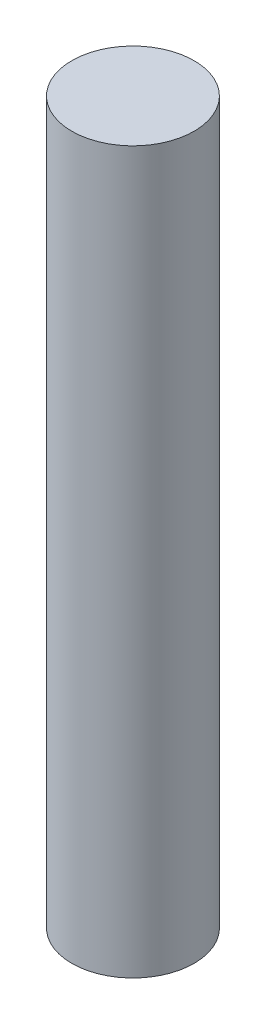
ISO-10303-21;
HEADER;
FILE_DESCRIPTION(('STEP AP214'),'2;1');
FILE_NAME('part.step','',(''),(''),'','','');
FILE_SCHEMA(('AUTOMOTIVE_DESIGN { 1 0 10303 214 1 1 1 1 }'));
ENDSEC;
DATA;
#1=APPLICATION_CONTEXT('core data for automotive mechanical design processes');
#2=APPLICATION_PROTOCOL_DEFINITION('international standard','automotive_design',2000,#1);
#3=PRODUCT_CONTEXT('',#1,'mechanical');
#4=PRODUCT('Part','Part','',(#3));
#5=PRODUCT_RELATED_PRODUCT_CATEGORY('part','',(#4));
#6=PRODUCT_DEFINITION_FORMATION('','',#4);
#7=PRODUCT_DEFINITION_CONTEXT('part definition',#1,'design');
#8=PRODUCT_DEFINITION('design','',#6,#7);
#9=PRODUCT_DEFINITION_SHAPE('','',#8);
#10=(LENGTH_UNIT() NAMED_UNIT(*) SI_UNIT(.MILLI.,.METRE.));
#11=(NAMED_UNIT(*) PLANE_ANGLE_UNIT() SI_UNIT($,.RADIAN.));
#12=(NAMED_UNIT(*) SI_UNIT($,.STERADIAN.) SOLID_ANGLE_UNIT());
#13=UNCERTAINTY_MEASURE_WITH_UNIT(LENGTH_MEASURE(1.E-05),#10,'distance_accuracy_value','');
#14=(GEOMETRIC_REPRESENTATION_CONTEXT(3) GLOBAL_UNCERTAINTY_ASSIGNED_CONTEXT((#13)) GLOBAL_UNIT_ASSIGNED_CONTEXT((#10,
#11,#12)) REPRESENTATION_CONTEXT('',''));
#15=CARTESIAN_POINT('',(0.,0.,0.));
#16=DIRECTION('',(0.,0.,1.));
#17=DIRECTION('',(1.,0.,0.));
#18=AXIS2_PLACEMENT_3D('',#15,#16,#17);
#19=CARTESIAN_POINT('',(0.,70.7,0.));
#20=DIRECTION('',(0.,-1.,0.));
#21=DIRECTION('',(0.,0.,-1.));
#22=AXIS2_PLACEMENT_3D('',#19,#20,#21);
#23=CYLINDRICAL_SURFACE('',#22,6.);
#24=CARTESIAN_POINT('',(0.,70.7,0.));
#25=DIRECTION('',(0.,1.,0.));
#26=DIRECTION('',(0.,0.,1.));
#27=AXIS2_PLACEMENT_3D('',#24,#25,#26);
#28=CIRCLE('',#27,6.);
#29=CARTESIAN_POINT('',(0.,70.7,6.));
#30=VERTEX_POINT('',#29);
#31=EDGE_CURVE('E10',#30,#30,#28,.T.);
#32=ORIENTED_EDGE('',*,*,#31,.F.);
#33=EDGE_LOOP('',(#32));
#34=FACE_BOUND('',#33,.T.);
#35=CARTESIAN_POINT('',(0.,0.,0.));
#36=DIRECTION('',(0.,1.,0.));
#37=DIRECTION('',(0.,0.,1.));
#38=AXIS2_PLACEMENT_3D('',#35,#36,#37);
#39=CIRCLE('',#38,6.);
#40=CARTESIAN_POINT('',(0.,0.,6.));
#41=VERTEX_POINT('',#40);
#42=EDGE_CURVE('E40',#41,#41,#39,.T.);
#43=ORIENTED_EDGE('',*,*,#42,.T.);
#44=EDGE_LOOP('',(#43));
#45=FACE_BOUND('',#44,.T.);
#46=ADVANCED_FACE('F37',(#34,#45),#23,.T.);
#47=CARTESIAN_POINT('',(0.,70.7,0.));
#48=DIRECTION('',(0.,1.,0.));
#49=DIRECTION('',(0.,0.,1.));
#50=AXIS2_PLACEMENT_3D('',#47,#48,#49);
#51=PLANE('',#50);
#52=ORIENTED_EDGE('',*,*,#31,.T.);
#53=EDGE_LOOP('',(#52));
#54=FACE_BOUND('',#53,.T.);
#55=ADVANCED_FACE('F52',(#54),#51,.T.);
#56=CARTESIAN_POINT('',(0.,0.,0.));
#57=DIRECTION('',(0.,1.,0.));
#58=DIRECTION('',(0.,0.,1.));
#59=AXIS2_PLACEMENT_3D('',#56,#57,#58);
#60=PLANE('',#59);
#61=ORIENTED_EDGE('',*,*,#42,.F.);
#62=EDGE_LOOP('',(#61));
#63=FACE_BOUND('',#62,.T.);
#64=ADVANCED_FACE('F50',(#63),#60,.F.);
#65=CLOSED_SHELL('',(#46,#55,#64));
#66=MANIFOLD_SOLID_BREP('B2',#65);
#67=ADVANCED_BREP_SHAPE_REPRESENTATION('',(#18,#66),#14);
#68=SHAPE_DEFINITION_REPRESENTATION(#9,#67);
ENDSEC;
END-ISO-10303-21;
